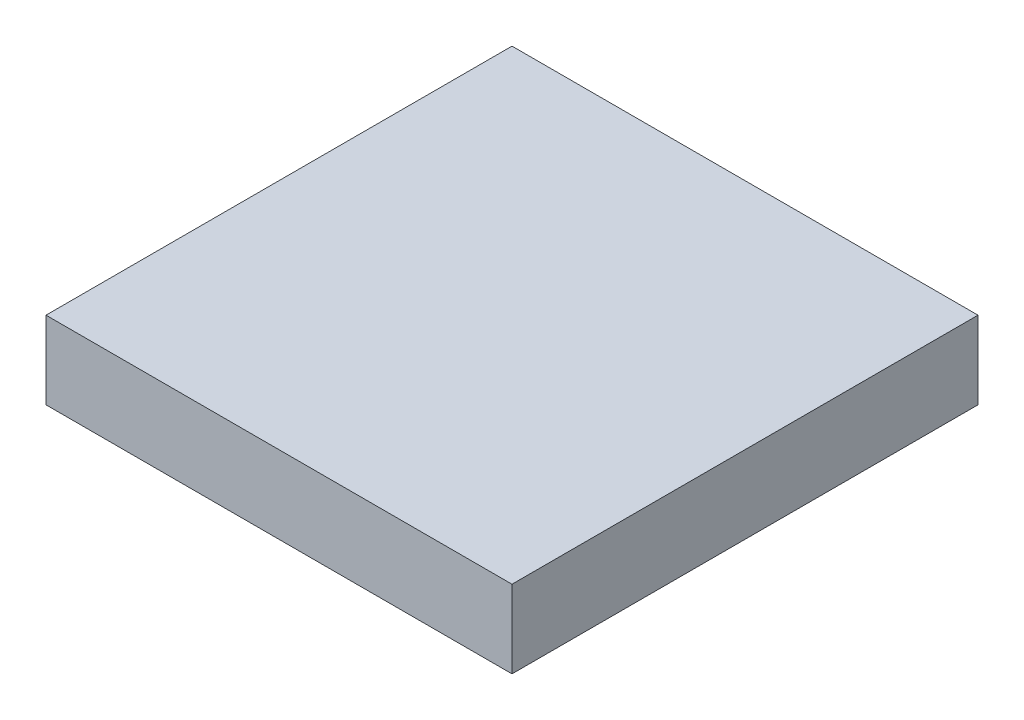
ISO-10303-21;
HEADER;
FILE_DESCRIPTION(('STEP AP214'),'2;1');
FILE_NAME('part.step','',(''),(''),'','','');
FILE_SCHEMA(('AUTOMOTIVE_DESIGN { 1 0 10303 214 1 1 1 1 }'));
ENDSEC;
DATA;
#1=APPLICATION_CONTEXT('core data for automotive mechanical design processes');
#2=APPLICATION_PROTOCOL_DEFINITION('international standard','automotive_design',2000,#1);
#3=PRODUCT_CONTEXT('',#1,'mechanical');
#4=PRODUCT('Part','Part','',(#3));
#5=PRODUCT_RELATED_PRODUCT_CATEGORY('part','',(#4));
#6=PRODUCT_DEFINITION_FORMATION('','',#4);
#7=PRODUCT_DEFINITION_CONTEXT('part definition',#1,'design');
#8=PRODUCT_DEFINITION('design','',#6,#7);
#9=PRODUCT_DEFINITION_SHAPE('','',#8);
#10=(LENGTH_UNIT() NAMED_UNIT(*) SI_UNIT(.MILLI.,.METRE.));
#11=(NAMED_UNIT(*) PLANE_ANGLE_UNIT() SI_UNIT($,.RADIAN.));
#12=(NAMED_UNIT(*) SI_UNIT($,.STERADIAN.) SOLID_ANGLE_UNIT());
#13=UNCERTAINTY_MEASURE_WITH_UNIT(LENGTH_MEASURE(1.E-05),#10,'distance_accuracy_value','');
#14=(GEOMETRIC_REPRESENTATION_CONTEXT(3) GLOBAL_UNCERTAINTY_ASSIGNED_CONTEXT((#13)) GLOBAL_UNIT_ASSIGNED_CONTEXT((#10,
#11,#12)) REPRESENTATION_CONTEXT('',''));
#15=CARTESIAN_POINT('',(0.,0.,0.));
#16=DIRECTION('',(0.,0.,1.));
#17=DIRECTION('',(1.,0.,0.));
#18=AXIS2_PLACEMENT_3D('',#15,#16,#17);
#19=CARTESIAN_POINT('',(0.,2.,-12.));
#20=DIRECTION('',(1.,0.,0.));
#21=DIRECTION('',(0.,0.,-1.));
#22=AXIS2_PLACEMENT_3D('',#19,#20,#21);
#23=PLANE('',#22);
#24=DIRECTION('',(0.,0.,1.));
#25=VECTOR('',#24,1.);
#26=CARTESIAN_POINT('',(0.,0.,-12.));
#27=LINE('',#26,#25);
#28=CARTESIAN_POINT('',(0.,0.,-12.));
#29=VERTEX_POINT('',#28);
#30=CARTESIAN_POINT('',(0.,0.,0.));
#31=VERTEX_POINT('',#30);
#32=EDGE_CURVE('E110',#29,#31,#27,.T.);
#33=ORIENTED_EDGE('',*,*,#32,.T.);
#34=DIRECTION('',(0.,-1.,0.));
#35=VECTOR('',#34,1.);
#36=CARTESIAN_POINT('',(0.,2.,0.));
#37=LINE('',#36,#35);
#38=CARTESIAN_POINT('',(0.,2.,0.));
#39=VERTEX_POINT('',#38);
#40=EDGE_CURVE('E11',#39,#31,#37,.T.);
#41=ORIENTED_EDGE('',*,*,#40,.F.);
#42=DIRECTION('',(0.,0.,1.));
#43=VECTOR('',#42,1.);
#44=CARTESIAN_POINT('',(0.,2.,-12.));
#45=LINE('',#44,#43);
#46=CARTESIAN_POINT('',(0.,2.,-12.));
#47=VERTEX_POINT('',#46);
#48=EDGE_CURVE('E94',#47,#39,#45,.T.);
#49=ORIENTED_EDGE('',*,*,#48,.F.);
#50=DIRECTION('',(0.,-1.,0.));
#51=VECTOR('',#50,1.);
#52=CARTESIAN_POINT('',(0.,2.,-12.));
#53=LINE('',#52,#51);
#54=EDGE_CURVE('E106',#47,#29,#53,.T.);
#55=ORIENTED_EDGE('',*,*,#54,.T.);
#56=EDGE_LOOP('',(#33,#41,#49,#55));
#57=FACE_BOUND('',#56,.T.);
#58=ADVANCED_FACE('F42',(#57),#23,.F.);
#59=CARTESIAN_POINT('',(0.,2.,0.));
#60=DIRECTION('',(0.,0.,-1.));
#61=DIRECTION('',(-1.,0.,0.));
#62=AXIS2_PLACEMENT_3D('',#59,#60,#61);
#63=PLANE('',#62);
#64=DIRECTION('',(1.,0.,0.));
#65=VECTOR('',#64,1.);
#66=CARTESIAN_POINT('',(0.,0.,0.));
#67=LINE('',#66,#65);
#68=CARTESIAN_POINT('',(12.,0.,0.));
#69=VERTEX_POINT('',#68);
#70=EDGE_CURVE('E99',#31,#69,#67,.T.);
#71=ORIENTED_EDGE('',*,*,#70,.T.);
#72=DIRECTION('',(0.,-1.,0.));
#73=VECTOR('',#72,1.);
#74=CARTESIAN_POINT('',(12.,2.,0.));
#75=LINE('',#74,#73);
#76=CARTESIAN_POINT('',(12.,2.,0.));
#77=VERTEX_POINT('',#76);
#78=EDGE_CURVE('E51',#77,#69,#75,.T.);
#79=ORIENTED_EDGE('',*,*,#78,.F.);
#80=DIRECTION('',(1.,0.,0.));
#81=VECTOR('',#80,1.);
#82=CARTESIAN_POINT('',(0.,2.,0.));
#83=LINE('',#82,#81);
#84=EDGE_CURVE('E89',#39,#77,#83,.T.);
#85=ORIENTED_EDGE('',*,*,#84,.F.);
#86=ORIENTED_EDGE('',*,*,#40,.T.);
#87=EDGE_LOOP('',(#71,#79,#85,#86));
#88=FACE_BOUND('',#87,.T.);
#89=ADVANCED_FACE('F98',(#88),#63,.F.);
#90=CARTESIAN_POINT('',(12.,2.,-12.));
#91=DIRECTION('',(-1.,0.,0.));
#92=DIRECTION('',(0.,0.,1.));
#93=AXIS2_PLACEMENT_3D('',#90,#91,#92);
#94=PLANE('',#93);
#95=DIRECTION('',(0.,0.,-1.));
#96=VECTOR('',#95,1.);
#97=CARTESIAN_POINT('',(12.,0.,-12.));
#98=LINE('',#97,#96);
#99=CARTESIAN_POINT('',(12.,0.,-12.));
#100=VERTEX_POINT('',#99);
#101=EDGE_CURVE('E76',#69,#100,#98,.T.);
#102=ORIENTED_EDGE('',*,*,#101,.T.);
#103=DIRECTION('',(0.,-1.,0.));
#104=VECTOR('',#103,1.);
#105=CARTESIAN_POINT('',(12.,2.,-12.));
#106=LINE('',#105,#104);
#107=CARTESIAN_POINT('',(12.,2.,-12.));
#108=VERTEX_POINT('',#107);
#109=EDGE_CURVE('E101',#108,#100,#106,.T.);
#110=ORIENTED_EDGE('',*,*,#109,.F.);
#111=DIRECTION('',(0.,0.,-1.));
#112=VECTOR('',#111,1.);
#113=CARTESIAN_POINT('',(12.,2.,-12.));
#114=LINE('',#113,#112);
#115=EDGE_CURVE('E92',#77,#108,#114,.T.);
#116=ORIENTED_EDGE('',*,*,#115,.F.);
#117=ORIENTED_EDGE('',*,*,#78,.T.);
#118=EDGE_LOOP('',(#102,#110,#116,#117));
#119=FACE_BOUND('',#118,.T.);
#120=ADVANCED_FACE('F102',(#119),#94,.F.);
#121=CARTESIAN_POINT('',(0.,2.,-12.));
#122=DIRECTION('',(0.,0.,1.));
#123=DIRECTION('',(1.,0.,0.));
#124=AXIS2_PLACEMENT_3D('',#121,#122,#123);
#125=PLANE('',#124);
#126=DIRECTION('',(-1.,0.,0.));
#127=VECTOR('',#126,1.);
#128=CARTESIAN_POINT('',(0.,0.,-12.));
#129=LINE('',#128,#127);
#130=EDGE_CURVE('E82',#100,#29,#129,.T.);
#131=ORIENTED_EDGE('',*,*,#130,.T.);
#132=ORIENTED_EDGE('',*,*,#54,.F.);
#133=DIRECTION('',(-1.,0.,0.));
#134=VECTOR('',#133,1.);
#135=CARTESIAN_POINT('',(0.,2.,-12.));
#136=LINE('',#135,#134);
#137=EDGE_CURVE('E59',#108,#47,#136,.T.);
#138=ORIENTED_EDGE('',*,*,#137,.F.);
#139=ORIENTED_EDGE('',*,*,#109,.T.);
#140=EDGE_LOOP('',(#131,#132,#138,#139));
#141=FACE_BOUND('',#140,.T.);
#142=ADVANCED_FACE('F123',(#141),#125,.F.);
#143=CARTESIAN_POINT('',(0.,2.,0.));
#144=DIRECTION('',(0.,1.,0.));
#145=DIRECTION('',(0.,0.,1.));
#146=AXIS2_PLACEMENT_3D('',#143,#144,#145);
#147=PLANE('',#146);
#148=ORIENTED_EDGE('',*,*,#48,.T.);
#149=ORIENTED_EDGE('',*,*,#84,.T.);
#150=ORIENTED_EDGE('',*,*,#115,.T.);
#151=ORIENTED_EDGE('',*,*,#137,.T.);
#152=EDGE_LOOP('',(#148,#149,#150,#151));
#153=FACE_BOUND('',#152,.T.);
#154=ADVANCED_FACE('F90',(#153),#147,.T.);
#155=CARTESIAN_POINT('',(0.,0.,0.));
#156=DIRECTION('',(0.,1.,0.));
#157=DIRECTION('',(0.,0.,1.));
#158=AXIS2_PLACEMENT_3D('',#155,#156,#157);
#159=PLANE('',#158);
#160=ORIENTED_EDGE('',*,*,#32,.F.);
#161=ORIENTED_EDGE('',*,*,#130,.F.);
#162=ORIENTED_EDGE('',*,*,#101,.F.);
#163=ORIENTED_EDGE('',*,*,#70,.F.);
#164=EDGE_LOOP('',(#160,#161,#162,#163));
#165=FACE_BOUND('',#164,.T.);
#166=ADVANCED_FACE('F126',(#165),#159,.F.);
#167=CLOSED_SHELL('',(#58,#89,#120,#142,#154,#166));
#168=MANIFOLD_SOLID_BREP('B2',#167);
#169=ADVANCED_BREP_SHAPE_REPRESENTATION('',(#18,#168),#14);
#170=SHAPE_DEFINITION_REPRESENTATION(#9,#169);
ENDSEC;
END-ISO-10303-21;
